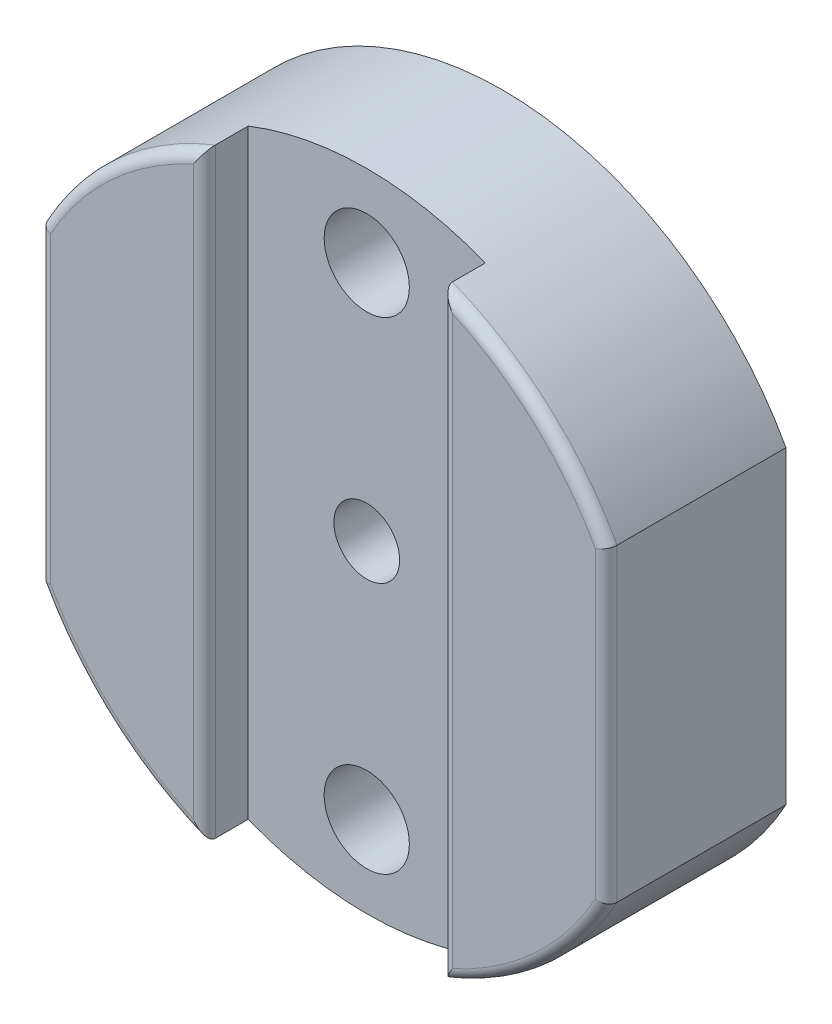
ISO-10303-21;
HEADER;
FILE_DESCRIPTION(('STEP AP214'),'2;1');
FILE_NAME('part.step','',(''),(''),'','','');
FILE_SCHEMA(('AUTOMOTIVE_DESIGN { 1 0 10303 214 1 1 1 1 }'));
ENDSEC;
DATA;
#1=APPLICATION_CONTEXT('core data for automotive mechanical design processes');
#2=APPLICATION_PROTOCOL_DEFINITION('international standard','automotive_design',2000,#1);
#3=PRODUCT_CONTEXT('',#1,'mechanical');
#4=PRODUCT('Part','Part','',(#3));
#5=PRODUCT_RELATED_PRODUCT_CATEGORY('part','',(#4));
#6=PRODUCT_DEFINITION_FORMATION('','',#4);
#7=PRODUCT_DEFINITION_CONTEXT('part definition',#1,'design');
#8=PRODUCT_DEFINITION('design','',#6,#7);
#9=PRODUCT_DEFINITION_SHAPE('','',#8);
#10=(LENGTH_UNIT() NAMED_UNIT(*) SI_UNIT(.MILLI.,.METRE.));
#11=(NAMED_UNIT(*) PLANE_ANGLE_UNIT() SI_UNIT($,.RADIAN.));
#12=(NAMED_UNIT(*) SI_UNIT($,.STERADIAN.) SOLID_ANGLE_UNIT());
#13=UNCERTAINTY_MEASURE_WITH_UNIT(LENGTH_MEASURE(1.E-05),#10,'distance_accuracy_value','');
#14=(GEOMETRIC_REPRESENTATION_CONTEXT(3) GLOBAL_UNCERTAINTY_ASSIGNED_CONTEXT((#13)) GLOBAL_UNIT_ASSIGNED_CONTEXT((#10,
#11,#12)) REPRESENTATION_CONTEXT('',''));
#15=CARTESIAN_POINT('',(0.,0.,0.));
#16=DIRECTION('',(0.,0.,1.));
#17=DIRECTION('',(1.,0.,0.));
#18=AXIS2_PLACEMENT_3D('',#15,#16,#17);
#19=CARTESIAN_POINT('',(0.,0.,0.));
#20=DIRECTION('',(0.,0.,-1.));
#21=DIRECTION('',(1.,0.,0.));
#22=AXIS2_PLACEMENT_3D('',#19,#20,#21);
#23=PLANE('',#22);
#24=CARTESIAN_POINT('',(0.,0.,0.));
#25=DIRECTION('',(0.,0.,-1.));
#26=DIRECTION('',(-1.,0.,0.));
#27=AXIS2_PLACEMENT_3D('',#24,#25,#26);
#28=CIRCLE('',#27,1.5);
#29=CARTESIAN_POINT('',(-1.5,0.,0.));
#30=VERTEX_POINT('',#29);
#31=EDGE_CURVE('E195',#30,#30,#28,.T.);
#32=ORIENTED_EDGE('',*,*,#31,.F.);
#33=EDGE_LOOP('',(#32));
#34=FACE_BOUND('',#33,.T.);
#35=CARTESIAN_POINT('',(0.,11.,0.));
#36=DIRECTION('',(0.,0.,-1.));
#37=DIRECTION('',(-1.,0.,0.));
#38=AXIS2_PLACEMENT_3D('',#35,#36,#37);
#39=CIRCLE('',#38,1.9431);
#40=CARTESIAN_POINT('',(-1.9431,11.,0.));
#41=VERTEX_POINT('',#40);
#42=EDGE_CURVE('E192',#41,#41,#39,.T.);
#43=ORIENTED_EDGE('',*,*,#42,.F.);
#44=EDGE_LOOP('',(#43));
#45=FACE_BOUND('',#44,.T.);
#46=CARTESIAN_POINT('',(0.,-11.,0.));
#47=DIRECTION('',(0.,0.,-1.));
#48=DIRECTION('',(1.,0.,0.));
#49=AXIS2_PLACEMENT_3D('',#46,#47,#48);
#50=CIRCLE('',#49,1.9431);
#51=CARTESIAN_POINT('',(1.9431,-11.,0.));
#52=VERTEX_POINT('',#51);
#53=EDGE_CURVE('E189',#52,#52,#50,.T.);
#54=ORIENTED_EDGE('',*,*,#53,.F.);
#55=EDGE_LOOP('',(#54));
#56=FACE_BOUND('',#55,.T.);
#57=DIRECTION('',(0.,1.,0.));
#58=VECTOR('',#57,1.);
#59=CARTESIAN_POINT('',(12.925,-7.0547856097829,0.));
#60=LINE('',#59,#58);
#61=CARTESIAN_POINT('',(12.925,-7.0547856097829,0.));
#62=VERTEX_POINT('',#61);
#63=CARTESIAN_POINT('',(12.925,7.05478560978291,0.));
#64=VERTEX_POINT('',#63);
#65=EDGE_CURVE('E152',#62,#64,#60,.T.);
#66=ORIENTED_EDGE('',*,*,#65,.F.);
#67=CARTESIAN_POINT('',(0.,0.,0.));
#68=DIRECTION('',(0.,0.,1.));
#69=DIRECTION('',(1.,0.,0.));
#70=AXIS2_PLACEMENT_3D('',#67,#68,#69);
#71=CIRCLE('',#70,14.725);
#72=CARTESIAN_POINT('',(-12.925,-7.0547856097829,0.));
#73=VERTEX_POINT('',#72);
#74=EDGE_CURVE('E154',#73,#62,#71,.T.);
#75=ORIENTED_EDGE('',*,*,#74,.F.);
#76=DIRECTION('',(0.,-1.,0.));
#77=VECTOR('',#76,1.);
#78=CARTESIAN_POINT('',(-12.925,7.05478560978291,0.));
#79=LINE('',#78,#77);
#80=CARTESIAN_POINT('',(-12.925,7.05478560978291,0.));
#81=VERTEX_POINT('',#80);
#82=EDGE_CURVE('E135',#81,#73,#79,.T.);
#83=ORIENTED_EDGE('',*,*,#82,.F.);
#84=CARTESIAN_POINT('',(0.,0.,0.));
#85=DIRECTION('',(0.,0.,1.));
#86=DIRECTION('',(1.,0.,0.));
#87=AXIS2_PLACEMENT_3D('',#84,#85,#86);
#88=CIRCLE('',#87,14.725);
#89=EDGE_CURVE('E146',#64,#81,#88,.T.);
#90=ORIENTED_EDGE('',*,*,#89,.F.);
#91=EDGE_LOOP('',(#66,#75,#83,#90));
#92=FACE_BOUND('',#91,.T.);
#93=ADVANCED_FACE('F32',(#34,#45,#56,#92),#23,.T.);
#94=CARTESIAN_POINT('',(0.,0.,8.2));
#95=DIRECTION('',(0.,0.,1.));
#96=DIRECTION('',(-1.,0.,0.));
#97=AXIS2_PLACEMENT_3D('',#94,#95,#96);
#98=PLANE('',#97);
#99=DIRECTION('',(0.,1.,0.));
#100=VECTOR('',#99,1.);
#101=CARTESIAN_POINT('',(-12.425,7.05478560978291,8.2));
#102=LINE('',#101,#100);
#103=CARTESIAN_POINT('',(-12.425,-6.92603782836912,8.2));
#104=VERTEX_POINT('',#103);
#105=CARTESIAN_POINT('',(-12.425,6.92603782836912,8.2));
#106=VERTEX_POINT('',#105);
#107=EDGE_CURVE('E230',#104,#106,#102,.T.);
#108=ORIENTED_EDGE('',*,*,#107,.F.);
#109=CARTESIAN_POINT('',(0.,0.,8.2));
#110=DIRECTION('',(0.,0.,-1.));
#111=DIRECTION('',(-1.,0.,0.));
#112=AXIS2_PLACEMENT_3D('',#109,#110,#111);
#113=CIRCLE('',#112,14.225);
#114=CARTESIAN_POINT('',(-5.90833333333334,-12.9399467627275,8.2));
#115=VERTEX_POINT('',#114);
#116=EDGE_CURVE('E227',#115,#104,#113,.T.);
#117=ORIENTED_EDGE('',*,*,#116,.F.);
#118=DIRECTION('',(0.,1.,0.));
#119=VECTOR('',#118,1.);
#120=CARTESIAN_POINT('',(-5.90833333333334,-13.6958225585598,8.2));
#121=LINE('',#120,#119);
#122=CARTESIAN_POINT('',(-5.90833333333334,12.9399467627275,8.2));
#123=VERTEX_POINT('',#122);
#124=EDGE_CURVE('E224',#123,#115,#121,.F.);
#125=ORIENTED_EDGE('',*,*,#124,.F.);
#126=CARTESIAN_POINT('',(0.,0.,8.2));
#127=DIRECTION('',(0.,0.,-1.));
#128=DIRECTION('',(-1.,0.,0.));
#129=AXIS2_PLACEMENT_3D('',#126,#127,#128);
#130=CIRCLE('',#129,14.225);
#131=EDGE_CURVE('E233',#106,#123,#130,.T.);
#132=ORIENTED_EDGE('',*,*,#131,.F.);
#133=EDGE_LOOP('',(#108,#117,#125,#132));
#134=FACE_BOUND('',#133,.T.);
#135=ADVANCED_FACE('F267',(#134),#98,.T.);
#136=CARTESIAN_POINT('',(0.,0.,8.2));
#137=DIRECTION('',(0.,0.,-1.));
#138=DIRECTION('',(-1.,0.,0.));
#139=AXIS2_PLACEMENT_3D('',#136,#137,#138);
#140=CIRCLE('',#139,14.225);
#141=CARTESIAN_POINT('',(5.90833333333333,12.9399467627275,8.2));
#142=VERTEX_POINT('',#141);
#143=CARTESIAN_POINT('',(12.425,6.92603782836911,8.2));
#144=VERTEX_POINT('',#143);
#145=EDGE_CURVE('E210',#142,#144,#140,.T.);
#146=ORIENTED_EDGE('',*,*,#145,.F.);
#147=DIRECTION('',(0.,-1.,0.));
#148=VECTOR('',#147,1.);
#149=CARTESIAN_POINT('',(5.90833333333333,13.6958225585598,8.2));
#150=LINE('',#149,#148);
#151=CARTESIAN_POINT('',(5.90833333333333,-12.9399467627275,8.2));
#152=VERTEX_POINT('',#151);
#153=EDGE_CURVE('E205',#152,#142,#150,.F.);
#154=ORIENTED_EDGE('',*,*,#153,.F.);
#155=CARTESIAN_POINT('',(0.,0.,8.2));
#156=DIRECTION('',(0.,0.,-1.));
#157=DIRECTION('',(-1.,0.,0.));
#158=AXIS2_PLACEMENT_3D('',#155,#156,#157);
#159=CIRCLE('',#158,14.225);
#160=CARTESIAN_POINT('',(12.425,-6.92603782836911,8.2));
#161=VERTEX_POINT('',#160);
#162=EDGE_CURVE('E208',#161,#152,#159,.T.);
#163=ORIENTED_EDGE('',*,*,#162,.F.);
#164=DIRECTION('',(0.,-1.,0.));
#165=VECTOR('',#164,1.);
#166=CARTESIAN_POINT('',(12.425,-7.0547856097829,8.2));
#167=LINE('',#166,#165);
#168=EDGE_CURVE('E213',#144,#161,#167,.T.);
#169=ORIENTED_EDGE('',*,*,#168,.F.);
#170=EDGE_LOOP('',(#146,#154,#163,#169));
#171=FACE_BOUND('',#170,.T.);
#172=ADVANCED_FACE('F271',(#171),#98,.T.);
#173=CARTESIAN_POINT('',(0.,0.,0.));
#174=DIRECTION('',(0.,0.,1.));
#175=DIRECTION('',(-1.,0.,0.));
#176=AXIS2_PLACEMENT_3D('',#173,#174,#175);
#177=CYLINDRICAL_SURFACE('',#176,1.5);
#178=CARTESIAN_POINT('',(0.,0.,6.2));
#179=DIRECTION('',(0.,0.,1.));
#180=DIRECTION('',(0.,1.,0.));
#181=AXIS2_PLACEMENT_3D('',#178,#179,#180);
#182=CIRCLE('',#181,1.5);
#183=CARTESIAN_POINT('',(0.,1.5,6.2));
#184=VERTEX_POINT('',#183);
#185=EDGE_CURVE('E182',#184,#184,#182,.T.);
#186=ORIENTED_EDGE('',*,*,#185,.T.);
#187=EDGE_LOOP('',(#186));
#188=FACE_BOUND('',#187,.T.);
#189=ORIENTED_EDGE('',*,*,#31,.T.);
#190=EDGE_LOOP('',(#189));
#191=FACE_BOUND('',#190,.T.);
#192=ADVANCED_FACE('F273',(#188,#191),#177,.F.);
#193=CARTESIAN_POINT('',(0.,11.,0.));
#194=DIRECTION('',(0.,0.,1.));
#195=DIRECTION('',(-1.,0.,0.));
#196=AXIS2_PLACEMENT_3D('',#193,#194,#195);
#197=CYLINDRICAL_SURFACE('',#196,1.9431);
#198=CARTESIAN_POINT('',(0.,11.,6.2));
#199=DIRECTION('',(0.,0.,1.));
#200=DIRECTION('',(1.,0.,0.));
#201=AXIS2_PLACEMENT_3D('',#198,#199,#200);
#202=CIRCLE('',#201,1.9431);
#203=CARTESIAN_POINT('',(1.9431,11.,6.2));
#204=VERTEX_POINT('',#203);
#205=EDGE_CURVE('E186',#204,#204,#202,.F.);
#206=ORIENTED_EDGE('',*,*,#205,.F.);
#207=EDGE_LOOP('',(#206));
#208=FACE_BOUND('',#207,.T.);
#209=ORIENTED_EDGE('',*,*,#42,.T.);
#210=EDGE_LOOP('',(#209));
#211=FACE_BOUND('',#210,.T.);
#212=ADVANCED_FACE('F276',(#208,#211),#197,.F.);
#213=CARTESIAN_POINT('',(0.,-11.,0.));
#214=DIRECTION('',(0.,0.,1.));
#215=DIRECTION('',(-1.,0.,0.));
#216=AXIS2_PLACEMENT_3D('',#213,#214,#215);
#217=CYLINDRICAL_SURFACE('',#216,1.9431);
#218=CARTESIAN_POINT('',(0.,-11.,6.2));
#219=DIRECTION('',(0.,0.,1.));
#220=DIRECTION('',(1.,0.,0.));
#221=AXIS2_PLACEMENT_3D('',#218,#219,#220);
#222=CIRCLE('',#221,1.9431);
#223=CARTESIAN_POINT('',(1.9431,-11.,6.2));
#224=VERTEX_POINT('',#223);
#225=EDGE_CURVE('E185',#224,#224,#222,.F.);
#226=ORIENTED_EDGE('',*,*,#225,.F.);
#227=EDGE_LOOP('',(#226));
#228=FACE_BOUND('',#227,.T.);
#229=ORIENTED_EDGE('',*,*,#53,.T.);
#230=EDGE_LOOP('',(#229));
#231=FACE_BOUND('',#230,.T.);
#232=ADVANCED_FACE('F280',(#228,#231),#217,.F.);
#233=CARTESIAN_POINT('',(0.,0.,6.2));
#234=DIRECTION('',(0.,0.,-1.));
#235=DIRECTION('',(0.,1.,0.));
#236=AXIS2_PLACEMENT_3D('',#233,#234,#235);
#237=PLANE('',#236);
#238=ORIENTED_EDGE('',*,*,#205,.T.);
#239=EDGE_LOOP('',(#238));
#240=FACE_BOUND('',#239,.T.);
#241=ORIENTED_EDGE('',*,*,#185,.F.);
#242=EDGE_LOOP('',(#241));
#243=FACE_BOUND('',#242,.T.);
#244=ORIENTED_EDGE('',*,*,#225,.T.);
#245=EDGE_LOOP('',(#244));
#246=FACE_BOUND('',#245,.T.);
#247=CARTESIAN_POINT('',(0.,0.,6.2));
#248=DIRECTION('',(0.,0.,1.));
#249=DIRECTION('',(1.,0.,0.));
#250=AXIS2_PLACEMENT_3D('',#247,#248,#249);
#251=CIRCLE('',#250,14.725);
#252=CARTESIAN_POINT('',(5.40833333333333,-13.6958225585598,6.2));
#253=VERTEX_POINT('',#252);
#254=CARTESIAN_POINT('',(-5.40833333333334,-13.6958225585598,6.2));
#255=VERTEX_POINT('',#254);
#256=EDGE_CURVE('E176',#253,#255,#251,.F.);
#257=ORIENTED_EDGE('',*,*,#256,.F.);
#258=DIRECTION('',(0.,-1.,0.));
#259=VECTOR('',#258,1.);
#260=CARTESIAN_POINT('',(5.40833333333333,13.7765352282256,6.2));
#261=LINE('',#260,#259);
#262=CARTESIAN_POINT('',(5.40833333333333,13.6958225585598,6.2));
#263=VERTEX_POINT('',#262);
#264=EDGE_CURVE('E161',#263,#253,#261,.T.);
#265=ORIENTED_EDGE('',*,*,#264,.F.);
#266=CARTESIAN_POINT('',(0.,0.,6.2));
#267=DIRECTION('',(0.,0.,1.));
#268=DIRECTION('',(1.,0.,0.));
#269=AXIS2_PLACEMENT_3D('',#266,#267,#268);
#270=CIRCLE('',#269,14.725);
#271=CARTESIAN_POINT('',(-5.40833333333334,13.6958225585598,6.2));
#272=VERTEX_POINT('',#271);
#273=EDGE_CURVE('E179',#272,#263,#270,.F.);
#274=ORIENTED_EDGE('',*,*,#273,.F.);
#275=DIRECTION('',(0.,1.,0.));
#276=VECTOR('',#275,1.);
#277=CARTESIAN_POINT('',(-5.40833333333334,-13.7765352282256,6.2));
#278=LINE('',#277,#276);
#279=EDGE_CURVE('E165',#255,#272,#278,.T.);
#280=ORIENTED_EDGE('',*,*,#279,.F.);
#281=EDGE_LOOP('',(#257,#265,#274,#280));
#282=FACE_BOUND('',#281,.T.);
#283=ADVANCED_FACE('F284',(#240,#243,#246,#282),#237,.F.);
#284=CARTESIAN_POINT('',(12.925,7.05478560978291,47.59746184718));
#285=DIRECTION('',(-1.,0.,0.));
#286=DIRECTION('',(0.,0.,-1.));
#287=AXIS2_PLACEMENT_3D('',#284,#285,#286);
#288=PLANE('',#287);
#289=DIRECTION('',(0.,0.,-1.));
#290=VECTOR('',#289,1.);
#291=CARTESIAN_POINT('',(12.925,-7.0547856097829,47.59746184718));
#292=LINE('',#291,#290);
#293=CARTESIAN_POINT('',(12.925,-7.0547856097829,7.7));
#294=VERTEX_POINT('',#293);
#295=EDGE_CURVE('E53',#294,#62,#292,.T.);
#296=ORIENTED_EDGE('',*,*,#295,.T.);
#297=ORIENTED_EDGE('',*,*,#65,.T.);
#298=DIRECTION('',(0.,0.,-1.));
#299=VECTOR('',#298,1.);
#300=CARTESIAN_POINT('',(12.925,7.05478560978291,47.59746184718));
#301=LINE('',#300,#299);
#302=CARTESIAN_POINT('',(12.925,7.05478560978291,7.7));
#303=VERTEX_POINT('',#302);
#304=EDGE_CURVE('E143',#303,#64,#301,.T.);
#305=ORIENTED_EDGE('',*,*,#304,.F.);
#306=DIRECTION('',(0.,-1.,0.));
#307=VECTOR('',#306,1.);
#308=CARTESIAN_POINT('',(12.925,7.05478560978291,7.7));
#309=LINE('',#308,#307);
#310=EDGE_CURVE('E216',#294,#303,#309,.F.);
#311=ORIENTED_EDGE('',*,*,#310,.F.);
#312=EDGE_LOOP('',(#296,#297,#305,#311));
#313=FACE_BOUND('',#312,.T.);
#314=ADVANCED_FACE('F288',(#313),#288,.F.);
#315=CARTESIAN_POINT('',(0.,0.,47.59746184718));
#316=DIRECTION('',(0.,0.,-1.));
#317=DIRECTION('',(1.,0.,0.));
#318=AXIS2_PLACEMENT_3D('',#315,#316,#317);
#319=CYLINDRICAL_SURFACE('',#318,14.725);
#320=ORIENTED_EDGE('',*,*,#304,.T.);
#321=ORIENTED_EDGE('',*,*,#89,.T.);
#322=DIRECTION('',(0.,0.,-1.));
#323=VECTOR('',#322,1.);
#324=CARTESIAN_POINT('',(-12.925,7.05478560978291,47.59746184718));
#325=LINE('',#324,#323);
#326=CARTESIAN_POINT('',(-12.925,7.05478560978291,7.7));
#327=VERTEX_POINT('',#326);
#328=EDGE_CURVE('E130',#327,#81,#325,.T.);
#329=ORIENTED_EDGE('',*,*,#328,.F.);
#330=CARTESIAN_POINT('',(0.,0.,7.7));
#331=DIRECTION('',(0.,0.,-1.));
#332=DIRECTION('',(-1.,0.,0.));
#333=AXIS2_PLACEMENT_3D('',#330,#331,#332);
#334=CIRCLE('',#333,14.725);
#335=CARTESIAN_POINT('',(-5.40833333333334,13.6958225585598,7.7));
#336=VERTEX_POINT('',#335);
#337=EDGE_CURVE('E219',#336,#327,#334,.F.);
#338=ORIENTED_EDGE('',*,*,#337,.F.);
#339=DIRECTION('',(0.,0.,-1.));
#340=VECTOR('',#339,1.);
#341=CARTESIAN_POINT('',(-5.40833333333334,13.6958225585598,47.59746184718));
#342=LINE('',#341,#340);
#343=EDGE_CURVE('E170',#272,#336,#342,.F.);
#344=ORIENTED_EDGE('',*,*,#343,.F.);
#345=ORIENTED_EDGE('',*,*,#273,.T.);
#346=DIRECTION('',(0.,0.,-1.));
#347=VECTOR('',#346,1.);
#348=CARTESIAN_POINT('',(5.40833333333333,13.6958225585598,47.59746184718));
#349=LINE('',#348,#347);
#350=CARTESIAN_POINT('',(5.40833333333333,13.6958225585598,7.7));
#351=VERTEX_POINT('',#350);
#352=EDGE_CURVE('E164',#351,#263,#349,.T.);
#353=ORIENTED_EDGE('',*,*,#352,.F.);
#354=CARTESIAN_POINT('',(0.,0.,7.7));
#355=DIRECTION('',(0.,0.,-1.));
#356=DIRECTION('',(-1.,0.,0.));
#357=AXIS2_PLACEMENT_3D('',#354,#355,#356);
#358=CIRCLE('',#357,14.725);
#359=EDGE_CURVE('E221',#303,#351,#358,.F.);
#360=ORIENTED_EDGE('',*,*,#359,.F.);
#361=EDGE_LOOP('',(#320,#321,#329,#338,#344,#345,#353,#360));
#362=FACE_BOUND('',#361,.T.);
#363=ADVANCED_FACE('F147',(#362),#319,.T.);
#364=CARTESIAN_POINT('',(-12.925,-7.05478560978291,47.59746184718));
#365=DIRECTION('',(1.,0.,0.));
#366=DIRECTION('',(0.,0.,1.));
#367=AXIS2_PLACEMENT_3D('',#364,#365,#366);
#368=PLANE('',#367);
#369=ORIENTED_EDGE('',*,*,#328,.T.);
#370=ORIENTED_EDGE('',*,*,#82,.T.);
#371=DIRECTION('',(0.,0.,-1.));
#372=VECTOR('',#371,1.);
#373=CARTESIAN_POINT('',(-12.925,-7.05478560978291,47.59746184718));
#374=LINE('',#373,#372);
#375=CARTESIAN_POINT('',(-12.925,-7.05478560978291,7.7));
#376=VERTEX_POINT('',#375);
#377=EDGE_CURVE('E142',#376,#73,#374,.T.);
#378=ORIENTED_EDGE('',*,*,#377,.F.);
#379=DIRECTION('',(0.,1.,0.));
#380=VECTOR('',#379,1.);
#381=CARTESIAN_POINT('',(-12.925,-7.05478560978291,7.7));
#382=LINE('',#381,#380);
#383=EDGE_CURVE('E138',#327,#376,#382,.F.);
#384=ORIENTED_EDGE('',*,*,#383,.F.);
#385=EDGE_LOOP('',(#369,#370,#378,#384));
#386=FACE_BOUND('',#385,.T.);
#387=ADVANCED_FACE('F132',(#386),#368,.F.);
#388=CARTESIAN_POINT('',(0.,0.,47.59746184718));
#389=DIRECTION('',(0.,0.,-1.));
#390=DIRECTION('',(1.,0.,0.));
#391=AXIS2_PLACEMENT_3D('',#388,#389,#390);
#392=CYLINDRICAL_SURFACE('',#391,14.725);
#393=ORIENTED_EDGE('',*,*,#377,.T.);
#394=ORIENTED_EDGE('',*,*,#74,.T.);
#395=ORIENTED_EDGE('',*,*,#295,.F.);
#396=CARTESIAN_POINT('',(0.,0.,7.7));
#397=DIRECTION('',(0.,0.,-1.));
#398=DIRECTION('',(-1.,0.,0.));
#399=AXIS2_PLACEMENT_3D('',#396,#397,#398);
#400=CIRCLE('',#399,14.725);
#401=CARTESIAN_POINT('',(5.40833333333333,-13.6958225585598,7.7));
#402=VERTEX_POINT('',#401);
#403=EDGE_CURVE('E237',#402,#294,#400,.F.);
#404=ORIENTED_EDGE('',*,*,#403,.F.);
#405=DIRECTION('',(0.,0.,-1.));
#406=VECTOR('',#405,1.);
#407=CARTESIAN_POINT('',(5.40833333333333,-13.6958225585598,47.59746184718));
#408=LINE('',#407,#406);
#409=EDGE_CURVE('E198',#253,#402,#408,.F.);
#410=ORIENTED_EDGE('',*,*,#409,.F.);
#411=ORIENTED_EDGE('',*,*,#256,.T.);
#412=DIRECTION('',(0.,0.,-1.));
#413=VECTOR('',#412,1.);
#414=CARTESIAN_POINT('',(-5.40833333333334,-13.6958225585598,47.59746184718));
#415=LINE('',#414,#413);
#416=CARTESIAN_POINT('',(-5.40833333333334,-13.6958225585598,7.7));
#417=VERTEX_POINT('',#416);
#418=EDGE_CURVE('E203',#417,#255,#415,.T.);
#419=ORIENTED_EDGE('',*,*,#418,.F.);
#420=CARTESIAN_POINT('',(0.,0.,7.7));
#421=DIRECTION('',(0.,0.,-1.));
#422=DIRECTION('',(-1.,0.,0.));
#423=AXIS2_PLACEMENT_3D('',#420,#421,#422);
#424=CIRCLE('',#423,14.725);
#425=EDGE_CURVE('E239',#376,#417,#424,.F.);
#426=ORIENTED_EDGE('',*,*,#425,.F.);
#427=EDGE_LOOP('',(#393,#394,#395,#404,#410,#411,#419,#426));
#428=FACE_BOUND('',#427,.T.);
#429=ADVANCED_FACE('F290',(#428),#392,.T.);
#430=CARTESIAN_POINT('',(5.40833333333333,13.7765352282256,-25.3042407278005));
#431=DIRECTION('',(1.,0.,0.));
#432=DIRECTION('',(0.,-1.,0.));
#433=AXIS2_PLACEMENT_3D('',#430,#431,#432);
#434=PLANE('',#433);
#435=ORIENTED_EDGE('',*,*,#352,.T.);
#436=ORIENTED_EDGE('',*,*,#264,.T.);
#437=ORIENTED_EDGE('',*,*,#409,.T.);
#438=DIRECTION('',(0.,-1.,0.));
#439=VECTOR('',#438,1.);
#440=CARTESIAN_POINT('',(5.40833333333333,-13.6958225585598,7.7));
#441=LINE('',#440,#439);
#442=EDGE_CURVE('E11',#351,#402,#441,.T.);
#443=ORIENTED_EDGE('',*,*,#442,.F.);
#444=EDGE_LOOP('',(#435,#436,#437,#443));
#445=FACE_BOUND('',#444,.T.);
#446=ADVANCED_FACE('F293',(#445),#434,.F.);
#447=CARTESIAN_POINT('',(-5.40833333333334,-13.7765352282256,-25.3042407278005));
#448=DIRECTION('',(-1.,0.,0.));
#449=DIRECTION('',(0.,0.,-1.));
#450=AXIS2_PLACEMENT_3D('',#447,#448,#449);
#451=PLANE('',#450);
#452=ORIENTED_EDGE('',*,*,#418,.T.);
#453=ORIENTED_EDGE('',*,*,#279,.T.);
#454=ORIENTED_EDGE('',*,*,#343,.T.);
#455=DIRECTION('',(0.,1.,0.));
#456=VECTOR('',#455,1.);
#457=CARTESIAN_POINT('',(-5.40833333333334,13.6958225585598,7.7));
#458=LINE('',#457,#456);
#459=EDGE_CURVE('E45',#417,#336,#458,.T.);
#460=ORIENTED_EDGE('',*,*,#459,.F.);
#461=EDGE_LOOP('',(#452,#453,#454,#460));
#462=FACE_BOUND('',#461,.T.);
#463=ADVANCED_FACE('F301',(#462),#451,.F.);
#464=CARTESIAN_POINT('',(5.90833333333333,13.7765352282256,7.7));
#465=DIRECTION('',(0.,1.,0.));
#466=DIRECTION('',(1.,0.,0.));
#467=AXIS2_PLACEMENT_3D('',#464,#465,#466);
#468=CYLINDRICAL_SURFACE('',#467,0.5);
#469=CARTESIAN_POINT('',(5.40833333333333,-13.6958225585598,7.7));
#470=CARTESIAN_POINT('',(5.40829384711575,-13.695879598566,7.719941830468));
#471=CARTESIAN_POINT('',(5.40952369239341,-13.6940727602276,7.73978940148304));
#472=CARTESIAN_POINT('',(5.4141518687906,-13.6872670984627,7.7784012695857));
#473=CARTESIAN_POINT('',(5.41752057898569,-13.6823118760416,7.79717660397759));
#474=CARTESIAN_POINT('',(5.42605070028256,-13.6697539347741,7.83322593198004));
#475=CARTESIAN_POINT('',(5.43120232346651,-13.6621656703427,7.8505074918031));
#476=CARTESIAN_POINT('',(5.44290701942942,-13.6449061619235,7.88353695736588));
#477=CARTESIAN_POINT('',(5.44946518556391,-13.6352273467318,7.89927897817633));
#478=CARTESIAN_POINT('',(5.46780994992915,-13.6081190393502,7.9379756218761));
#479=CARTESIAN_POINT('',(5.48039758049777,-13.5894870787892,7.95970205919639));
#480=CARTESIAN_POINT('',(5.50721969135807,-13.5496912465308,7.99947331858316));
#481=CARTESIAN_POINT('',(5.52145785607351,-13.5285217065654,8.01750964541701));
#482=CARTESIAN_POINT('',(5.56128397375436,-13.4691546405264,8.06189994921482));
#483=CARTESIAN_POINT('',(5.58785259761357,-13.4293922076742,8.08526320085064));
#484=CARTESIAN_POINT('',(5.64239695399889,-13.3473703668457,8.12474602810753));
#485=CARTESIAN_POINT('',(5.67037582777217,-13.3051053443137,8.14084855946047));
#486=CARTESIAN_POINT('',(5.73277862982028,-13.2103709129947,8.16967257126196));
#487=CARTESIAN_POINT('',(5.76734785958036,-13.1575859662553,8.18102398407752));
#488=CARTESIAN_POINT('',(5.83660347142049,-13.0511828706045,8.19609023690708));
#489=CARTESIAN_POINT('',(5.87128952136998,-12.9975664315286,8.1998190752563));
#490=CARTESIAN_POINT('',(5.90664314051842,-12.9425763434006,8.19999784560914));
#491=CARTESIAN_POINT('',(5.9074882921977,-12.9412615677605,8.1999999872699));
#492=CARTESIAN_POINT('',(5.90833333333333,-12.9399467627275,8.2));
#493=B_SPLINE_CURVE_WITH_KNOTS('',3,(#469,#470,#471,#472,#473,#474,#475,#476,#477,#478,#479,
#480,#481,#482,#483,#484,#485,#486,#487,#488,#489,#490,#491,#492),.UNSPECIFIED.,.F.,.F.,(4,2,2,
2,2,2,2,2,2,2,2,4),(0.,0.0595569344149248,0.118306544031723,0.176738613426599,0.235385960805569,
0.328654967272641,0.422136336140694,0.580917982757283,0.7400704472067,0.931853045733306,
1.12328313112064,1.1279720778607),.UNSPECIFIED.);
#494=EDGE_CURVE('E61',#402,#152,#493,.T.);
#495=ORIENTED_EDGE('',*,*,#494,.T.);
#496=ORIENTED_EDGE('',*,*,#153,.T.);
#497=CARTESIAN_POINT('',(5.40833333333333,13.6958225585598,7.7));
#498=CARTESIAN_POINT('',(5.40829384711576,13.695879598566,7.719941830468));
#499=CARTESIAN_POINT('',(5.40952369239341,13.6940727602276,7.73978940148304));
#500=CARTESIAN_POINT('',(5.4141518687906,13.6872670984627,7.7784012695857));
#501=CARTESIAN_POINT('',(5.41752057898569,13.6823118760416,7.79717660397759));
#502=CARTESIAN_POINT('',(5.42605070028256,13.6697539347741,7.83322593198004));
#503=CARTESIAN_POINT('',(5.43120232346651,13.6621656703427,7.8505074918031));
#504=CARTESIAN_POINT('',(5.44290701942943,13.6449061619235,7.88353695736588));
#505=CARTESIAN_POINT('',(5.44946518556391,13.6352273467318,7.89927897817633));
#506=CARTESIAN_POINT('',(5.46780994992915,13.6081190393502,7.9379756218761));
#507=CARTESIAN_POINT('',(5.48039758049777,13.5894870787892,7.95970205919639));
#508=CARTESIAN_POINT('',(5.50721969135808,13.5496912465308,7.99947331858316));
#509=CARTESIAN_POINT('',(5.52145785607351,13.5285217065654,8.01750964541701));
#510=CARTESIAN_POINT('',(5.56128397375436,13.4691546405264,8.06189994921482));
#511=CARTESIAN_POINT('',(5.58785259761357,13.4293922076742,8.08526320085064));
#512=CARTESIAN_POINT('',(5.6423969539989,13.3473703668457,8.12474602810753));
#513=CARTESIAN_POINT('',(5.67037582777217,13.3051053443137,8.14084855946047));
#514=CARTESIAN_POINT('',(5.73277862982028,13.2103709129947,8.16967257126196));
#515=CARTESIAN_POINT('',(5.76734785958036,13.1575859662553,8.18102398407752));
#516=CARTESIAN_POINT('',(5.8366034714205,13.0511828706045,8.19609023690708));
#517=CARTESIAN_POINT('',(5.87128952137001,12.9975664315286,8.1998190752563));
#518=CARTESIAN_POINT('',(5.90664314051842,12.9425763434006,8.19999784560914));
#519=CARTESIAN_POINT('',(5.9074882921977,12.9412615677605,8.1999999872699));
#520=CARTESIAN_POINT('',(5.90833333333333,12.9399467627275,8.2));
#521=B_SPLINE_CURVE_WITH_KNOTS('',3,(#497,#498,#499,#500,#501,#502,#503,#504,#505,#506,#507,
#508,#509,#510,#511,#512,#513,#514,#515,#516,#517,#518,#519,#520),.UNSPECIFIED.,.F.,.F.,(4,2,2,
2,2,2,2,2,2,2,2,4),(0.,0.0595569344149248,0.118306544031722,0.176738613426599,0.235385960805567,
0.328654967272641,0.422136336140694,0.580917982757281,0.740070447206701,0.931853045733306,
1.12328313112064,1.1279720778607),.UNSPECIFIED.);
#522=EDGE_CURVE('E168',#142,#351,#521,.F.);
#523=ORIENTED_EDGE('',*,*,#522,.T.);
#524=ORIENTED_EDGE('',*,*,#442,.T.);
#525=EDGE_LOOP('',(#495,#496,#523,#524));
#526=FACE_BOUND('',#525,.T.);
#527=ADVANCED_FACE('F304',(#526),#468,.T.);
#528=CARTESIAN_POINT('',(0.,0.,7.7));
#529=DIRECTION('',(0.,0.,1.));
#530=DIRECTION('',(-1.,0.,0.));
#531=AXIS2_PLACEMENT_3D('',#528,#529,#530);
#532=TOROIDAL_SURFACE('',#531,14.225,0.5);
#533=ORIENTED_EDGE('',*,*,#522,.F.);
#534=ORIENTED_EDGE('',*,*,#145,.T.);
#535=CARTESIAN_POINT('',(12.925,7.05478560978291,7.7));
#536=CARTESIAN_POINT('',(12.9250266323857,7.05479212371006,7.72749455468149));
#537=CARTESIAN_POINT('',(12.9227338797823,7.05420741475499,7.7549769169648));
#538=CARTESIAN_POINT('',(12.9137117403836,7.051905035872,7.80911166730306));
#539=CARTESIAN_POINT('',(12.9069893970008,7.05018916458298,7.83576530275926));
#540=CARTESIAN_POINT('',(12.8893074890651,7.04567326307848,7.88753363655224));
#541=CARTESIAN_POINT('',(12.8783471767862,7.04287304154559,7.91264806241229));
#542=CARTESIAN_POINT('',(12.8525527536699,7.03627748327187,7.96065449676721));
#543=CARTESIAN_POINT('',(12.8377185854038,7.0324821317785,7.983546472308));
#544=CARTESIAN_POINT('',(12.8044129996094,7.02395224587444,8.0268039876973));
#545=CARTESIAN_POINT('',(12.785896231308,7.01920599525172,8.04713226339118));
#546=CARTESIAN_POINT('',(12.7459022962359,7.0089424712527,8.08440773414089));
#547=CARTESIAN_POINT('',(12.7244241035228,7.00342493066499,8.10135375246148));
#548=CARTESIAN_POINT('',(12.6784478260235,6.99159839623789,8.1319128863403));
#549=CARTESIAN_POINT('',(12.6538791601634,6.98527080681206,8.14541247425757));
#550=CARTESIAN_POINT('',(12.6029485976585,6.97213439101674,8.168092411324));
#551=CARTESIAN_POINT('',(12.5765873360122,6.96532573502439,8.17727428092702));
#552=CARTESIAN_POINT('',(12.530313819227,6.95335566721117,8.18919402943552));
#553=CARTESIAN_POINT('',(12.5106532927152,6.94826441011486,8.19301489810037));
#554=CARTESIAN_POINT('',(12.4710610425511,6.93800014210565,8.1982728186992));
#555=CARTESIAN_POINT('',(12.4511298513832,6.9328272891742,8.19971401442419));
#556=CARTESIAN_POINT('',(12.4291352993358,6.92711248439711,8.19998720375143));
#557=CARTESIAN_POINT('',(12.4270675381202,6.92657515892462,8.20000003349121));
#558=CARTESIAN_POINT('',(12.425,6.92603782836911,8.2));
#559=B_SPLINE_CURVE_WITH_KNOTS('',3,(#535,#536,#537,#538,#539,#540,#541,#542,#543,#544,#545,
#546,#547,#548,#549,#550,#551,#552,#553,#554,#555,#556,#557,#558),.UNSPECIFIED.,.F.,.F.,(4,2,2,
2,2,2,2,2,2,2,2,4),(0.,0.0823636118122214,0.164596573741562,0.246844051064696,0.32909274775221,
0.412425196138169,0.495786586717777,0.581615979981275,0.667415126357681,0.729286551030306,
0.791050123201682,0.797459363185674),.UNSPECIFIED.);
#560=EDGE_CURVE('E251',#144,#303,#559,.F.);
#561=ORIENTED_EDGE('',*,*,#560,.T.);
#562=ORIENTED_EDGE('',*,*,#359,.T.);
#563=EDGE_LOOP('',(#533,#534,#561,#562));
#564=FACE_BOUND('',#563,.T.);
#565=ADVANCED_FACE('F337',(#564),#532,.T.);
#566=CARTESIAN_POINT('',(0.,0.,7.7));
#567=DIRECTION('',(0.,0.,1.));
#568=DIRECTION('',(-1.,0.,0.));
#569=AXIS2_PLACEMENT_3D('',#566,#567,#568);
#570=TOROIDAL_SURFACE('',#569,14.225,0.5);
#571=ORIENTED_EDGE('',*,*,#494,.F.);
#572=ORIENTED_EDGE('',*,*,#403,.T.);
#573=CARTESIAN_POINT('',(12.925,-7.0547856097829,7.7));
#574=CARTESIAN_POINT('',(12.9250266323857,-7.05479212371006,7.72749455468149));
#575=CARTESIAN_POINT('',(12.9227338797823,-7.054207414755,7.7549769169648));
#576=CARTESIAN_POINT('',(12.9137117403836,-7.05190503587201,7.80911166730306));
#577=CARTESIAN_POINT('',(12.9069893970008,-7.05018916458298,7.83576530275926));
#578=CARTESIAN_POINT('',(12.8893074890651,-7.04567326307848,7.88753363655224));
#579=CARTESIAN_POINT('',(12.8783471767862,-7.04287304154559,7.91264806241229));
#580=CARTESIAN_POINT('',(12.8525527536699,-7.03627748327187,7.96065449676721));
#581=CARTESIAN_POINT('',(12.8377185854038,-7.0324821317785,7.983546472308));
#582=CARTESIAN_POINT('',(12.8044129996094,-7.02395224587444,8.0268039876973));
#583=CARTESIAN_POINT('',(12.785896231308,-7.01920599525172,8.04713226339118));
#584=CARTESIAN_POINT('',(12.7459022962359,-7.0089424712527,8.08440773414089));
#585=CARTESIAN_POINT('',(12.7244241035228,-7.003424930665,8.10135375246148));
#586=CARTESIAN_POINT('',(12.6784478260235,-6.99159839623789,8.1319128863403));
#587=CARTESIAN_POINT('',(12.6538791601634,-6.98527080681206,8.14541247425757));
#588=CARTESIAN_POINT('',(12.6029485976585,-6.97213439101674,8.168092411324));
#589=CARTESIAN_POINT('',(12.5765873360122,-6.96532573502439,8.17727428092702));
#590=CARTESIAN_POINT('',(12.530313819227,-6.95335566721117,8.18919402943552));
#591=CARTESIAN_POINT('',(12.5106532927152,-6.94826441011485,8.19301489810037));
#592=CARTESIAN_POINT('',(12.4710610425511,-6.93800014210566,8.1982728186992));
#593=CARTESIAN_POINT('',(12.4511298513832,-6.93282728917425,8.19971401442419));
#594=CARTESIAN_POINT('',(12.4291352993358,-6.92711248439711,8.19998720375143));
#595=CARTESIAN_POINT('',(12.4270675381202,-6.92657515892463,8.20000003349121));
#596=CARTESIAN_POINT('',(12.425,-6.92603782836911,8.2));
#597=B_SPLINE_CURVE_WITH_KNOTS('',3,(#573,#574,#575,#576,#577,#578,#579,#580,#581,#582,#583,
#584,#585,#586,#587,#588,#589,#590,#591,#592,#593,#594,#595,#596),.UNSPECIFIED.,.F.,.F.,(4,2,2,
2,2,2,2,2,2,2,2,4),(0.,0.0823636118122213,0.164596573741562,0.246844051064696,0.32909274775221,
0.412425196138169,0.495786586717777,0.581615979981275,0.667415126357681,0.729286551030308,
0.791050123201684,0.797459363185674),.UNSPECIFIED.);
#598=EDGE_CURVE('E244',#294,#161,#597,.T.);
#599=ORIENTED_EDGE('',*,*,#598,.T.);
#600=ORIENTED_EDGE('',*,*,#162,.T.);
#601=EDGE_LOOP('',(#571,#572,#599,#600));
#602=FACE_BOUND('',#601,.T.);
#603=ADVANCED_FACE('F257',(#602),#570,.T.);
#604=CARTESIAN_POINT('',(12.425,0.,7.7));
#605=DIRECTION('',(0.,1.,0.));
#606=DIRECTION('',(0.,0.,1.));
#607=AXIS2_PLACEMENT_3D('',#604,#605,#606);
#608=CYLINDRICAL_SURFACE('',#607,0.5);
#609=ORIENTED_EDGE('',*,*,#560,.F.);
#610=ORIENTED_EDGE('',*,*,#168,.T.);
#611=ORIENTED_EDGE('',*,*,#598,.F.);
#612=ORIENTED_EDGE('',*,*,#310,.T.);
#613=EDGE_LOOP('',(#609,#610,#611,#612));
#614=FACE_BOUND('',#613,.T.);
#615=ADVANCED_FACE('F259',(#614),#608,.T.);
#616=CARTESIAN_POINT('',(0.,0.,7.7));
#617=DIRECTION('',(0.,0.,1.));
#618=DIRECTION('',(-1.,0.,0.));
#619=AXIS2_PLACEMENT_3D('',#616,#617,#618);
#620=TOROIDAL_SURFACE('',#619,14.225,0.5);
#621=CARTESIAN_POINT('',(-5.40833333333334,-13.6958225585598,7.7));
#622=CARTESIAN_POINT('',(-5.40829384711576,-13.695879598566,7.719941830468));
#623=CARTESIAN_POINT('',(-5.40952369239342,-13.6940727602276,7.73978940148304));
#624=CARTESIAN_POINT('',(-5.41415186879061,-13.6872670984627,7.7784012695857));
#625=CARTESIAN_POINT('',(-5.41752057898569,-13.6823118760416,7.79717660397759));
#626=CARTESIAN_POINT('',(-5.42605070028257,-13.6697539347741,7.83322593198004));
#627=CARTESIAN_POINT('',(-5.43120232346651,-13.6621656703427,7.8505074918031));
#628=CARTESIAN_POINT('',(-5.44290701942943,-13.6449061619235,7.88353695736588));
#629=CARTESIAN_POINT('',(-5.44946518556391,-13.6352273467318,7.89927897817633));
#630=CARTESIAN_POINT('',(-5.46780994992916,-13.6081190393502,7.9379756218761));
#631=CARTESIAN_POINT('',(-5.48039758049777,-13.5894870787892,7.95970205919639));
#632=CARTESIAN_POINT('',(-5.50721969135808,-13.5496912465308,7.99947331858316));
#633=CARTESIAN_POINT('',(-5.52145785607352,-13.5285217065654,8.01750964541702));
#634=CARTESIAN_POINT('',(-5.56128397375437,-13.4691546405264,8.06189994921482));
#635=CARTESIAN_POINT('',(-5.58785259761358,-13.4293922076742,8.08526320085065));
#636=CARTESIAN_POINT('',(-5.64239695399891,-13.3473703668457,8.12474602810753));
#637=CARTESIAN_POINT('',(-5.67037582777218,-13.3051053443137,8.14084855946047));
#638=CARTESIAN_POINT('',(-5.73277862982029,-13.2103709129947,8.16967257126196));
#639=CARTESIAN_POINT('',(-5.76734785958037,-13.1575859662553,8.18102398407752));
#640=CARTESIAN_POINT('',(-5.83660347142051,-13.0511828706045,8.19609023690708));
#641=CARTESIAN_POINT('',(-5.87128952137001,-12.9975664315286,8.1998190752563));
#642=CARTESIAN_POINT('',(-5.90664314051843,-12.9425763434006,8.19999784560914));
#643=CARTESIAN_POINT('',(-5.90748829219771,-12.9412615677605,8.1999999872699));
#644=CARTESIAN_POINT('',(-5.90833333333334,-12.9399467627275,8.2));
#645=B_SPLINE_CURVE_WITH_KNOTS('',3,(#621,#622,#623,#624,#625,#626,#627,#628,#629,#630,#631,
#632,#633,#634,#635,#636,#637,#638,#639,#640,#641,#642,#643,#644),.UNSPECIFIED.,.F.,.F.,(4,2,2,
2,2,2,2,2,2,2,2,4),(0.,0.0595569344149239,0.118306544031723,0.176738613426598,0.235385960805569,
0.328654967272645,0.422136336140699,0.580917982757292,0.740070447206714,0.931853045733312,
1.12328313112064,1.1279720778607),.UNSPECIFIED.);
#646=EDGE_CURVE('E355',#417,#115,#645,.T.);
#647=ORIENTED_EDGE('',*,*,#646,.T.);
#648=ORIENTED_EDGE('',*,*,#116,.T.);
#649=CARTESIAN_POINT('',(-12.925,-7.05478560978291,7.7));
#650=CARTESIAN_POINT('',(-12.9250266323857,-7.05479212371007,7.72749455468149));
#651=CARTESIAN_POINT('',(-12.9227338797823,-7.054207414755,7.7549769169648));
#652=CARTESIAN_POINT('',(-12.9137117403835,-7.05190503587201,7.80911166730306));
#653=CARTESIAN_POINT('',(-12.9069893970008,-7.05018916458298,7.83576530275926));
#654=CARTESIAN_POINT('',(-12.8893074890651,-7.04567326307848,7.88753363655224));
#655=CARTESIAN_POINT('',(-12.8783471767862,-7.0428730415456,7.91264806241229));
#656=CARTESIAN_POINT('',(-12.8525527536699,-7.03627748327188,7.96065449676721));
#657=CARTESIAN_POINT('',(-12.8377185854038,-7.03248213177851,7.983546472308));
#658=CARTESIAN_POINT('',(-12.8044129996094,-7.02395224587445,8.0268039876973));
#659=CARTESIAN_POINT('',(-12.7858962313079,-7.01920599525173,8.04713226339118));
#660=CARTESIAN_POINT('',(-12.7459022962359,-7.0089424712527,8.08440773414089));
#661=CARTESIAN_POINT('',(-12.7244241035228,-7.003424930665,8.10135375246148));
#662=CARTESIAN_POINT('',(-12.6784478260235,-6.99159839623789,8.1319128863403));
#663=CARTESIAN_POINT('',(-12.6538791601634,-6.98527080681207,8.14541247425757));
#664=CARTESIAN_POINT('',(-12.6029485976585,-6.97213439101675,8.168092411324));
#665=CARTESIAN_POINT('',(-12.5765873360122,-6.96532573502439,8.17727428092702));
#666=CARTESIAN_POINT('',(-12.530313819227,-6.95335566721118,8.18919402943552));
#667=CARTESIAN_POINT('',(-12.5106532927152,-6.94826441011487,8.19301489810037));
#668=CARTESIAN_POINT('',(-12.4710610425511,-6.93800014210566,8.1982728186992));
#669=CARTESIAN_POINT('',(-12.4511298513832,-6.93282728917421,8.19971401442419));
#670=CARTESIAN_POINT('',(-12.4291352993358,-6.92711248439711,8.19998720375143));
#671=CARTESIAN_POINT('',(-12.4270675381202,-6.92657515892463,8.20000003349121));
#672=CARTESIAN_POINT('',(-12.425,-6.92603782836912,8.2));
#673=B_SPLINE_CURVE_WITH_KNOTS('',3,(#649,#650,#651,#652,#653,#654,#655,#656,#657,#658,#659,
#660,#661,#662,#663,#664,#665,#666,#667,#668,#669,#670,#671,#672),.UNSPECIFIED.,.F.,.F.,(4,2,2,
2,2,2,2,2,2,2,2,4),(0.,0.0823636118122206,0.164596573741562,0.246844051064696,0.329092747752209,
0.412425196138169,0.495786586717778,0.581615979981276,0.667415126357682,0.729286551030307,
0.791050123201682,0.797459363185674),.UNSPECIFIED.);
#674=EDGE_CURVE('E37',#104,#376,#673,.F.);
#675=ORIENTED_EDGE('',*,*,#674,.T.);
#676=ORIENTED_EDGE('',*,*,#425,.T.);
#677=EDGE_LOOP('',(#647,#648,#675,#676));
#678=FACE_BOUND('',#677,.T.);
#679=ADVANCED_FACE('F34',(#678),#620,.T.);
#680=CARTESIAN_POINT('',(-12.425,0.,7.7));
#681=DIRECTION('',(0.,-1.,0.));
#682=DIRECTION('',(0.,0.,-1.));
#683=AXIS2_PLACEMENT_3D('',#680,#681,#682);
#684=CYLINDRICAL_SURFACE('',#683,0.5);
#685=ORIENTED_EDGE('',*,*,#674,.F.);
#686=ORIENTED_EDGE('',*,*,#107,.T.);
#687=CARTESIAN_POINT('',(-12.925,7.05478560978291,7.7));
#688=CARTESIAN_POINT('',(-12.9250266323857,7.05479212371007,7.72749455468149));
#689=CARTESIAN_POINT('',(-12.9227338797823,7.054207414755,7.7549769169648));
#690=CARTESIAN_POINT('',(-12.9137117403835,7.05190503587201,7.80911166730306));
#691=CARTESIAN_POINT('',(-12.9069893970008,7.05018916458299,7.83576530275926));
#692=CARTESIAN_POINT('',(-12.8893074890651,7.04567326307849,7.88753363655224));
#693=CARTESIAN_POINT('',(-12.8783471767862,7.0428730415456,7.91264806241228));
#694=CARTESIAN_POINT('',(-12.8525527536699,7.03627748327187,7.96065449676721));
#695=CARTESIAN_POINT('',(-12.8377185854038,7.03248213177852,7.983546472308));
#696=CARTESIAN_POINT('',(-12.8044129996094,7.02395224587445,8.0268039876973));
#697=CARTESIAN_POINT('',(-12.7858962313079,7.01920599525173,8.04713226339118));
#698=CARTESIAN_POINT('',(-12.7459022962358,7.0089424712527,8.08440773414089));
#699=CARTESIAN_POINT('',(-12.7244241035228,7.003424930665,8.10135375246148));
#700=CARTESIAN_POINT('',(-12.6784478260235,6.9915983962379,8.1319128863403));
#701=CARTESIAN_POINT('',(-12.6538791601634,6.98527080681207,8.14541247425757));
#702=CARTESIAN_POINT('',(-12.6029485976585,6.97213439101674,8.168092411324));
#703=CARTESIAN_POINT('',(-12.5765873360122,6.96532573502439,8.17727428092702));
#704=CARTESIAN_POINT('',(-12.530313819227,6.95335566721118,8.18919402943552));
#705=CARTESIAN_POINT('',(-12.5106532927152,6.94826441011486,8.19301489810037));
#706=CARTESIAN_POINT('',(-12.4710610425511,6.93800014210565,8.1982728186992));
#707=CARTESIAN_POINT('',(-12.4511298513832,6.9328272891742,8.19971401442419));
#708=CARTESIAN_POINT('',(-12.4291352993358,6.92711248439711,8.19998720375143));
#709=CARTESIAN_POINT('',(-12.4270675381202,6.92657515892463,8.20000003349121));
#710=CARTESIAN_POINT('',(-12.425,6.92603782836912,8.2));
#711=B_SPLINE_CURVE_WITH_KNOTS('',3,(#687,#688,#689,#690,#691,#692,#693,#694,#695,#696,#697,
#698,#699,#700,#701,#702,#703,#704,#705,#706,#707,#708,#709,#710),.UNSPECIFIED.,.F.,.F.,(4,2,2,
2,2,2,2,2,2,2,2,4),(0.,0.0823636118122205,0.164596573741562,0.246844051064694,0.329092747752209,
0.412425196138168,0.495786586717778,0.581615979981275,0.667415126357682,0.729286551030303,
0.791050123201682,0.797459363185674),.UNSPECIFIED.);
#712=EDGE_CURVE('E157',#106,#327,#711,.F.);
#713=ORIENTED_EDGE('',*,*,#712,.T.);
#714=ORIENTED_EDGE('',*,*,#383,.T.);
#715=EDGE_LOOP('',(#685,#686,#713,#714));
#716=FACE_BOUND('',#715,.T.);
#717=ADVANCED_FACE('F359',(#716),#684,.T.);
#718=CARTESIAN_POINT('',(-5.90833333333334,-13.7765352282256,7.7));
#719=DIRECTION('',(0.,-1.,0.));
#720=DIRECTION('',(0.,0.,-1.));
#721=AXIS2_PLACEMENT_3D('',#718,#719,#720);
#722=CYLINDRICAL_SURFACE('',#721,0.5);
#723=ORIENTED_EDGE('',*,*,#646,.F.);
#724=ORIENTED_EDGE('',*,*,#459,.T.);
#725=CARTESIAN_POINT('',(-5.40833333333334,13.6958225585598,7.7));
#726=CARTESIAN_POINT('',(-5.40829384711576,13.695879598566,7.719941830468));
#727=CARTESIAN_POINT('',(-5.40952369239342,13.6940727602276,7.73978940148304));
#728=CARTESIAN_POINT('',(-5.41415186879061,13.6872670984627,7.7784012695857));
#729=CARTESIAN_POINT('',(-5.41752057898569,13.6823118760416,7.79717660397759));
#730=CARTESIAN_POINT('',(-5.42605070028257,13.6697539347741,7.83322593198004));
#731=CARTESIAN_POINT('',(-5.43120232346651,13.6621656703427,7.8505074918031));
#732=CARTESIAN_POINT('',(-5.44290701942943,13.6449061619235,7.88353695736588));
#733=CARTESIAN_POINT('',(-5.44946518556391,13.6352273467318,7.89927897817633));
#734=CARTESIAN_POINT('',(-5.46780994992916,13.6081190393502,7.9379756218761));
#735=CARTESIAN_POINT('',(-5.48039758049777,13.5894870787892,7.95970205919639));
#736=CARTESIAN_POINT('',(-5.50721969135808,13.5496912465308,7.99947331858316));
#737=CARTESIAN_POINT('',(-5.52145785607352,13.5285217065654,8.01750964541702));
#738=CARTESIAN_POINT('',(-5.56128397375437,13.4691546405264,8.06189994921482));
#739=CARTESIAN_POINT('',(-5.58785259761358,13.4293922076742,8.08526320085065));
#740=CARTESIAN_POINT('',(-5.64239695399891,13.3473703668457,8.12474602810753));
#741=CARTESIAN_POINT('',(-5.67037582777218,13.3051053443137,8.14084855946047));
#742=CARTESIAN_POINT('',(-5.73277862982029,13.2103709129947,8.16967257126196));
#743=CARTESIAN_POINT('',(-5.76734785958037,13.1575859662553,8.18102398407752));
#744=CARTESIAN_POINT('',(-5.83660347142051,13.0511828706045,8.19609023690708));
#745=CARTESIAN_POINT('',(-5.87128952137001,12.9975664315286,8.1998190752563));
#746=CARTESIAN_POINT('',(-5.90664314051843,12.9425763434006,8.19999784560914));
#747=CARTESIAN_POINT('',(-5.90748829219771,12.9412615677605,8.1999999872699));
#748=CARTESIAN_POINT('',(-5.90833333333334,12.9399467627275,8.2));
#749=B_SPLINE_CURVE_WITH_KNOTS('',3,(#725,#726,#727,#728,#729,#730,#731,#732,#733,#734,#735,
#736,#737,#738,#739,#740,#741,#742,#743,#744,#745,#746,#747,#748),.UNSPECIFIED.,.F.,.F.,(4,2,2,
2,2,2,2,2,2,2,2,4),(0.,0.0595569344149239,0.118306544031723,0.176738613426598,0.235385960805569,
0.328654967272645,0.422136336140699,0.580917982757292,0.740070447206714,0.931853045733312,
1.12328313112064,1.1279720778607),.UNSPECIFIED.);
#750=EDGE_CURVE('E155',#336,#123,#749,.T.);
#751=ORIENTED_EDGE('',*,*,#750,.T.);
#752=ORIENTED_EDGE('',*,*,#124,.T.);
#753=EDGE_LOOP('',(#723,#724,#751,#752));
#754=FACE_BOUND('',#753,.T.);
#755=ADVANCED_FACE('F344',(#754),#722,.T.);
#756=CARTESIAN_POINT('',(0.,0.,7.7));
#757=DIRECTION('',(0.,0.,1.));
#758=DIRECTION('',(-1.,0.,0.));
#759=AXIS2_PLACEMENT_3D('',#756,#757,#758);
#760=TOROIDAL_SURFACE('',#759,14.225,0.5);
#761=ORIENTED_EDGE('',*,*,#712,.F.);
#762=ORIENTED_EDGE('',*,*,#131,.T.);
#763=ORIENTED_EDGE('',*,*,#750,.F.);
#764=ORIENTED_EDGE('',*,*,#337,.T.);
#765=EDGE_LOOP('',(#761,#762,#763,#764));
#766=FACE_BOUND('',#765,.T.);
#767=ADVANCED_FACE('F339',(#766),#760,.T.);
#768=CLOSED_SHELL('',(#93,#135,#172,#192,#212,#232,#283,#314,#363,#387,#429,#446,#463,#527,#565,
#603,#615,#679,#717,#755,#767));
#769=MANIFOLD_SOLID_BREP('B2',#768);
#770=ADVANCED_BREP_SHAPE_REPRESENTATION('',(#18,#769),#14);
#771=SHAPE_DEFINITION_REPRESENTATION(#9,#770);
ENDSEC;
END-ISO-10303-21;
